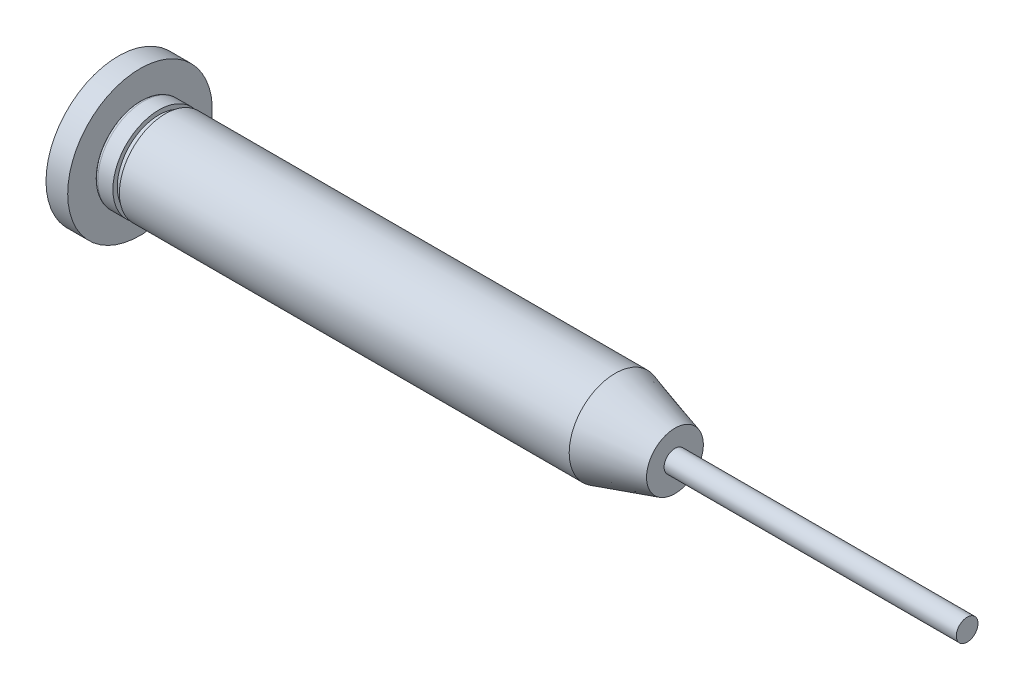
ISO-10303-21;
HEADER;
FILE_DESCRIPTION(('STEP AP214'),'2;1');
FILE_NAME('part.step','',(''),(''),'','','');
FILE_SCHEMA(('AUTOMOTIVE_DESIGN { 1 0 10303 214 1 1 1 1 }'));
ENDSEC;
DATA;
#1=APPLICATION_CONTEXT('core data for automotive mechanical design processes');
#2=APPLICATION_PROTOCOL_DEFINITION('international standard','automotive_design',2000,#1);
#3=PRODUCT_CONTEXT('',#1,'mechanical');
#4=PRODUCT('Part','Part','',(#3));
#5=PRODUCT_RELATED_PRODUCT_CATEGORY('part','',(#4));
#6=PRODUCT_DEFINITION_FORMATION('','',#4);
#7=PRODUCT_DEFINITION_CONTEXT('part definition',#1,'design');
#8=PRODUCT_DEFINITION('design','',#6,#7);
#9=PRODUCT_DEFINITION_SHAPE('','',#8);
#10=(LENGTH_UNIT() NAMED_UNIT(*) SI_UNIT(.MILLI.,.METRE.));
#11=(NAMED_UNIT(*) PLANE_ANGLE_UNIT() SI_UNIT($,.RADIAN.));
#12=(NAMED_UNIT(*) SI_UNIT($,.STERADIAN.) SOLID_ANGLE_UNIT());
#13=UNCERTAINTY_MEASURE_WITH_UNIT(LENGTH_MEASURE(1.E-05),#10,'distance_accuracy_value','');
#14=(GEOMETRIC_REPRESENTATION_CONTEXT(3) GLOBAL_UNCERTAINTY_ASSIGNED_CONTEXT((#13)) GLOBAL_UNIT_ASSIGNED_CONTEXT((#10,
#11,#12)) REPRESENTATION_CONTEXT('',''));
#15=CARTESIAN_POINT('',(0.,0.,0.));
#16=DIRECTION('',(0.,0.,1.));
#17=DIRECTION('',(1.,0.,0.));
#18=AXIS2_PLACEMENT_3D('',#15,#16,#17);
#19=CARTESIAN_POINT('',(20.5559332380975,0.375,0.));
#20=DIRECTION('',(-1.,0.,0.));
#21=DIRECTION('',(0.,0.,1.));
#22=AXIS2_PLACEMENT_3D('',#19,#20,#21);
#23=PLANE('',#22);
#24=CARTESIAN_POINT('',(20.5559332380975,-1.5875,0.));
#25=DIRECTION('',(-1.,0.,0.));
#26=DIRECTION('',(0.,0.,1.));
#27=AXIS2_PLACEMENT_3D('',#24,#25,#26);
#28=CIRCLE('',#27,1.9625);
#29=CARTESIAN_POINT('',(20.5559332380975,-1.5875,1.9625));
#30=VERTEX_POINT('',#29);
#31=EDGE_CURVE('E65',#30,#30,#28,.T.);
#32=ORIENTED_EDGE('',*,*,#31,.F.);
#33=EDGE_LOOP('',(#32));
#34=FACE_BOUND('',#33,.T.);
#35=CARTESIAN_POINT('',(20.5559332380975,-1.5875,0.));
#36=DIRECTION('',(-1.,0.,0.));
#37=DIRECTION('',(0.,0.,1.));
#38=AXIS2_PLACEMENT_3D('',#35,#36,#37);
#39=CIRCLE('',#38,0.750000000000001);
#40=CARTESIAN_POINT('',(20.5559332380975,-1.5875,0.750000000000001));
#41=VERTEX_POINT('',#40);
#42=EDGE_CURVE('E10',#41,#41,#39,.F.);
#43=ORIENTED_EDGE('',*,*,#42,.F.);
#44=EDGE_LOOP('',(#43));
#45=FACE_BOUND('',#44,.T.);
#46=ADVANCED_FACE('F32',(#34,#45),#23,.F.);
#47=CARTESIAN_POINT('',(-16.42,-1.5875,0.));
#48=DIRECTION('',(-1.,0.,0.));
#49=DIRECTION('',(0.,0.,1.));
#50=AXIS2_PLACEMENT_3D('',#47,#48,#49);
#51=CYLINDRICAL_SURFACE('',#50,3.175);
#52=CARTESIAN_POINT('',(-16.17,-1.5875,0.));
#53=DIRECTION('',(1.,0.,0.));
#54=DIRECTION('',(0.,0.,-1.));
#55=AXIS2_PLACEMENT_3D('',#52,#53,#54);
#56=CIRCLE('',#55,3.175);
#57=CARTESIAN_POINT('',(-16.17,-1.5875,-3.175));
#58=VERTEX_POINT('',#57);
#59=EDGE_CURVE('E40',#58,#58,#56,.T.);
#60=ORIENTED_EDGE('',*,*,#59,.T.);
#61=EDGE_LOOP('',(#60));
#62=FACE_BOUND('',#61,.T.);
#63=CARTESIAN_POINT('',(-15.12,-1.5875,0.));
#64=DIRECTION('',(-1.,0.,0.));
#65=DIRECTION('',(0.,0.,1.));
#66=AXIS2_PLACEMENT_3D('',#63,#64,#65);
#67=CIRCLE('',#66,3.175);
#68=CARTESIAN_POINT('',(-15.12,-1.5875,3.175));
#69=VERTEX_POINT('',#68);
#70=EDGE_CURVE('E48',#69,#69,#67,.T.);
#71=ORIENTED_EDGE('',*,*,#70,.T.);
#72=EDGE_LOOP('',(#71));
#73=FACE_BOUND('',#72,.T.);
#74=ADVANCED_FACE('F114',(#62,#73),#51,.T.);
#75=CARTESIAN_POINT('',(-15.12,1.5875,0.));
#76=DIRECTION('',(-1.,0.,0.));
#77=DIRECTION('',(0.,0.,1.));
#78=AXIS2_PLACEMENT_3D('',#75,#76,#77);
#79=PLANE('',#78);
#80=ORIENTED_EDGE('',*,*,#70,.F.);
#81=EDGE_LOOP('',(#80));
#82=FACE_BOUND('',#81,.T.);
#83=CARTESIAN_POINT('',(-15.12,-1.5875,0.));
#84=DIRECTION('',(-1.,0.,0.));
#85=DIRECTION('',(0.,0.,1.));
#86=AXIS2_PLACEMENT_3D('',#83,#84,#85);
#87=CIRCLE('',#86,2.875);
#88=CARTESIAN_POINT('',(-15.12,-1.5875,2.875));
#89=VERTEX_POINT('',#88);
#90=EDGE_CURVE('E53',#89,#89,#87,.T.);
#91=ORIENTED_EDGE('',*,*,#90,.T.);
#92=EDGE_LOOP('',(#91));
#93=FACE_BOUND('',#92,.T.);
#94=ADVANCED_FACE('F120',(#82,#93),#79,.F.);
#95=CARTESIAN_POINT('',(-16.42,-1.5875,0.));
#96=DIRECTION('',(-1.,0.,0.));
#97=DIRECTION('',(0.,0.,1.));
#98=AXIS2_PLACEMENT_3D('',#95,#96,#97);
#99=CYLINDRICAL_SURFACE('',#98,2.875);
#100=ORIENTED_EDGE('',*,*,#90,.F.);
#101=EDGE_LOOP('',(#100));
#102=FACE_BOUND('',#101,.T.);
#103=CARTESIAN_POINT('',(-14.67,-1.5875,0.));
#104=DIRECTION('',(-1.,0.,0.));
#105=DIRECTION('',(0.,0.,1.));
#106=AXIS2_PLACEMENT_3D('',#103,#104,#105);
#107=CIRCLE('',#106,2.875);
#108=CARTESIAN_POINT('',(-14.67,-1.5875,2.875));
#109=VERTEX_POINT('',#108);
#110=EDGE_CURVE('E56',#109,#109,#107,.T.);
#111=ORIENTED_EDGE('',*,*,#110,.T.);
#112=EDGE_LOOP('',(#111));
#113=FACE_BOUND('',#112,.T.);
#114=ADVANCED_FACE('F131',(#102,#113),#99,.T.);
#115=CARTESIAN_POINT('',(-14.67,1.2875,0.));
#116=DIRECTION('',(1.,0.,0.));
#117=DIRECTION('',(0.,0.,-1.));
#118=AXIS2_PLACEMENT_3D('',#115,#116,#117);
#119=PLANE('',#118);
#120=ORIENTED_EDGE('',*,*,#110,.F.);
#121=EDGE_LOOP('',(#120));
#122=FACE_BOUND('',#121,.T.);
#123=CARTESIAN_POINT('',(-14.67,-1.5875,0.));
#124=DIRECTION('',(-1.,0.,0.));
#125=DIRECTION('',(0.,0.,1.));
#126=AXIS2_PLACEMENT_3D('',#123,#124,#125);
#127=CIRCLE('',#126,3.175);
#128=CARTESIAN_POINT('',(-14.67,-1.5875,3.175));
#129=VERTEX_POINT('',#128);
#130=EDGE_CURVE('E59',#129,#129,#127,.T.);
#131=ORIENTED_EDGE('',*,*,#130,.T.);
#132=EDGE_LOOP('',(#131));
#133=FACE_BOUND('',#132,.T.);
#134=ADVANCED_FACE('F127',(#122,#133),#119,.F.);
#135=CARTESIAN_POINT('',(-16.42,-1.5875,0.));
#136=DIRECTION('',(-1.,0.,0.));
#137=DIRECTION('',(0.,0.,1.));
#138=AXIS2_PLACEMENT_3D('',#135,#136,#137);
#139=CYLINDRICAL_SURFACE('',#138,3.175);
#140=ORIENTED_EDGE('',*,*,#130,.F.);
#141=EDGE_LOOP('',(#140));
#142=FACE_BOUND('',#141,.T.);
#143=CARTESIAN_POINT('',(16.42,-1.5875,0.));
#144=DIRECTION('',(-1.,0.,0.));
#145=DIRECTION('',(0.,0.,1.));
#146=AXIS2_PLACEMENT_3D('',#143,#144,#145);
#147=CIRCLE('',#146,3.175);
#148=CARTESIAN_POINT('',(16.42,-1.5875,3.175));
#149=VERTEX_POINT('',#148);
#150=EDGE_CURVE('E62',#149,#149,#147,.T.);
#151=ORIENTED_EDGE('',*,*,#150,.T.);
#152=EDGE_LOOP('',(#151));
#153=FACE_BOUND('',#152,.T.);
#154=ADVANCED_FACE('F110',(#142,#153),#139,.T.);
#155=CARTESIAN_POINT('',(20.5559332380975,-1.5875,0.));
#156=DIRECTION('',(-1.,0.,0.));
#157=DIRECTION('',(0.,0.,1.));
#158=AXIS2_PLACEMENT_3D('',#155,#156,#157);
#159=CONICAL_SURFACE('',#158,1.9625,0.285171996728483);
#160=ORIENTED_EDGE('',*,*,#150,.F.);
#161=EDGE_LOOP('',(#160));
#162=FACE_BOUND('',#161,.T.);
#163=ORIENTED_EDGE('',*,*,#31,.T.);
#164=EDGE_LOOP('',(#163));
#165=FACE_BOUND('',#164,.T.);
#166=ADVANCED_FACE('F102',(#162,#165),#159,.T.);
#167=CARTESIAN_POINT('',(-16.17,-1.5875,0.));
#168=DIRECTION('',(1.,0.,0.));
#169=DIRECTION('',(0.,0.,-1.));
#170=AXIS2_PLACEMENT_3D('',#167,#168,#169);
#171=TOROIDAL_SURFACE('',#170,2.925,0.25);
#172=ORIENTED_EDGE('',*,*,#59,.F.);
#173=EDGE_LOOP('',(#172));
#174=FACE_BOUND('',#173,.T.);
#175=CARTESIAN_POINT('',(-16.42,-1.5875,0.));
#176=DIRECTION('',(1.,0.,0.));
#177=DIRECTION('',(0.,0.,-1.));
#178=AXIS2_PLACEMENT_3D('',#175,#176,#177);
#179=CIRCLE('',#178,2.925);
#180=CARTESIAN_POINT('',(-16.42,-1.5875,-2.925));
#181=VERTEX_POINT('',#180);
#182=EDGE_CURVE('E44',#181,#181,#179,.F.);
#183=ORIENTED_EDGE('',*,*,#182,.F.);
#184=EDGE_LOOP('',(#183));
#185=FACE_BOUND('',#184,.T.);
#186=ADVANCED_FACE('F34',(#174,#185),#171,.T.);
#187=CARTESIAN_POINT('',(40.7559332380975,-1.5875,0.));
#188=DIRECTION('',(-1.,0.,0.));
#189=DIRECTION('',(0.,0.,1.));
#190=AXIS2_PLACEMENT_3D('',#187,#188,#189);
#191=PLANE('',#190);
#192=CARTESIAN_POINT('',(40.7559332380975,-1.5875,0.));
#193=DIRECTION('',(-1.,0.,0.));
#194=DIRECTION('',(0.,0.,1.));
#195=AXIS2_PLACEMENT_3D('',#192,#193,#194);
#196=CIRCLE('',#195,0.750000000000003);
#197=CARTESIAN_POINT('',(40.7559332380975,-1.5875,0.750000000000003));
#198=VERTEX_POINT('',#197);
#199=EDGE_CURVE('E68',#198,#198,#196,.T.);
#200=ORIENTED_EDGE('',*,*,#199,.F.);
#201=EDGE_LOOP('',(#200));
#202=FACE_BOUND('',#201,.T.);
#203=ADVANCED_FACE('F101',(#202),#191,.F.);
#204=CARTESIAN_POINT('',(20.5559332380975,-1.5875,0.));
#205=DIRECTION('',(-1.,0.,0.));
#206=DIRECTION('',(0.,0.,1.));
#207=AXIS2_PLACEMENT_3D('',#204,#205,#206);
#208=CYLINDRICAL_SURFACE('',#207,0.750000000000001);
#209=ORIENTED_EDGE('',*,*,#42,.T.);
#210=EDGE_LOOP('',(#209));
#211=FACE_BOUND('',#210,.T.);
#212=ORIENTED_EDGE('',*,*,#199,.T.);
#213=EDGE_LOOP('',(#212));
#214=FACE_BOUND('',#213,.T.);
#215=ADVANCED_FACE('F95',(#211,#214),#208,.T.);
#216=CARTESIAN_POINT('',(-16.42,-1.5875,0.));
#217=DIRECTION('',(-1.,0.,0.));
#218=DIRECTION('',(0.,0.,1.));
#219=AXIS2_PLACEMENT_3D('',#216,#217,#218);
#220=PLANE('',#219);
#221=CARTESIAN_POINT('',(-16.42,-1.5875,0.));
#222=DIRECTION('',(-1.,0.,0.));
#223=DIRECTION('',(0.,0.,1.));
#224=AXIS2_PLACEMENT_3D('',#221,#222,#223);
#225=CIRCLE('',#224,5.);
#226=CARTESIAN_POINT('',(-16.42,-1.5875,5.));
#227=VERTEX_POINT('',#226);
#228=EDGE_CURVE('E78',#227,#227,#225,.T.);
#229=ORIENTED_EDGE('',*,*,#228,.F.);
#230=EDGE_LOOP('',(#229));
#231=FACE_BOUND('',#230,.T.);
#232=ORIENTED_EDGE('',*,*,#182,.T.);
#233=EDGE_LOOP('',(#232));
#234=FACE_BOUND('',#233,.T.);
#235=ADVANCED_FACE('F89',(#231,#234),#220,.F.);
#236=CARTESIAN_POINT('',(-17.92,-1.5875,0.));
#237=DIRECTION('',(1.,0.,0.));
#238=DIRECTION('',(0.,0.,-1.));
#239=AXIS2_PLACEMENT_3D('',#236,#237,#238);
#240=CYLINDRICAL_SURFACE('',#239,5.);
#241=CARTESIAN_POINT('',(-17.92,-1.5875,0.));
#242=DIRECTION('',(-1.,0.,0.));
#243=DIRECTION('',(0.,0.,1.));
#244=AXIS2_PLACEMENT_3D('',#241,#242,#243);
#245=CIRCLE('',#244,5.);
#246=CARTESIAN_POINT('',(-17.92,-1.5875,5.));
#247=VERTEX_POINT('',#246);
#248=EDGE_CURVE('E77',#247,#247,#245,.T.);
#249=ORIENTED_EDGE('',*,*,#248,.F.);
#250=EDGE_LOOP('',(#249));
#251=FACE_BOUND('',#250,.T.);
#252=ORIENTED_EDGE('',*,*,#228,.T.);
#253=EDGE_LOOP('',(#252));
#254=FACE_BOUND('',#253,.T.);
#255=ADVANCED_FACE('F86',(#251,#254),#240,.T.);
#256=CARTESIAN_POINT('',(-17.92,-1.5875,0.));
#257=DIRECTION('',(-1.,0.,0.));
#258=DIRECTION('',(0.,0.,1.));
#259=AXIS2_PLACEMENT_3D('',#256,#257,#258);
#260=PLANE('',#259);
#261=ORIENTED_EDGE('',*,*,#248,.T.);
#262=EDGE_LOOP('',(#261));
#263=FACE_BOUND('',#262,.T.);
#264=ADVANCED_FACE('F84',(#263),#260,.T.);
#265=CLOSED_SHELL('',(#46,#74,#94,#114,#134,#154,#166,#186,#203,#215,#235,#255,#264));
#266=CARTESIAN_POINT('',(-1.42,-1.5875,0.));
#267=DIRECTION('',(-1.,0.,0.));
#268=DIRECTION('',(0.,0.,1.));
#269=AXIS2_PLACEMENT_3D('',#266,#267,#268);
#270=PLANE('',#269);
#271=CARTESIAN_POINT('',(-1.42,-1.5875,0.));
#272=DIRECTION('',(-1.,0.,0.));
#273=DIRECTION('',(0.,0.,1.));
#274=AXIS2_PLACEMENT_3D('',#271,#272,#273);
#275=CIRCLE('',#274,1.5);
#276=CARTESIAN_POINT('',(-1.42,-1.5875,1.5));
#277=VERTEX_POINT('',#276);
#278=EDGE_CURVE('E71',#277,#277,#275,.T.);
#279=ORIENTED_EDGE('',*,*,#278,.T.);
#280=EDGE_LOOP('',(#279));
#281=FACE_BOUND('',#280,.T.);
#282=ADVANCED_FACE('F205',(#281),#270,.T.);
#283=CARTESIAN_POINT('',(-1.42,-1.5875,0.));
#284=DIRECTION('',(-1.,0.,0.));
#285=DIRECTION('',(0.,0.,1.));
#286=AXIS2_PLACEMENT_3D('',#283,#284,#285);
#287=CYLINDRICAL_SURFACE('',#286,1.5);
#288=ORIENTED_EDGE('',*,*,#278,.F.);
#289=EDGE_LOOP('',(#288));
#290=FACE_BOUND('',#289,.T.);
#291=CARTESIAN_POINT('',(-16.42,-1.5875,0.));
#292=DIRECTION('',(-1.,0.,0.));
#293=DIRECTION('',(0.,0.,1.));
#294=AXIS2_PLACEMENT_3D('',#291,#292,#293);
#295=CIRCLE('',#294,1.5);
#296=CARTESIAN_POINT('',(-16.42,-1.5875,1.5));
#297=VERTEX_POINT('',#296);
#298=EDGE_CURVE('E74',#297,#297,#295,.F.);
#299=ORIENTED_EDGE('',*,*,#298,.F.);
#300=EDGE_LOOP('',(#299));
#301=FACE_BOUND('',#300,.T.);
#302=ADVANCED_FACE('F202',(#290,#301),#287,.F.);
#303=ORIENTED_EDGE('',*,*,#298,.T.);
#304=EDGE_LOOP('',(#303));
#305=FACE_BOUND('',#304,.T.);
#306=ADVANCED_FACE('F97',(#305),#220,.F.);
#307=CLOSED_SHELL('',(#282,#302,#306));
#308=ORIENTED_CLOSED_SHELL('',*,#307,.T.);
#309=BREP_WITH_VOIDS('B2',#265,(#308));
#310=ADVANCED_BREP_SHAPE_REPRESENTATION('',(#18,#309),#14);
#311=SHAPE_DEFINITION_REPRESENTATION(#9,#310);
ENDSEC;
END-ISO-10303-21;
